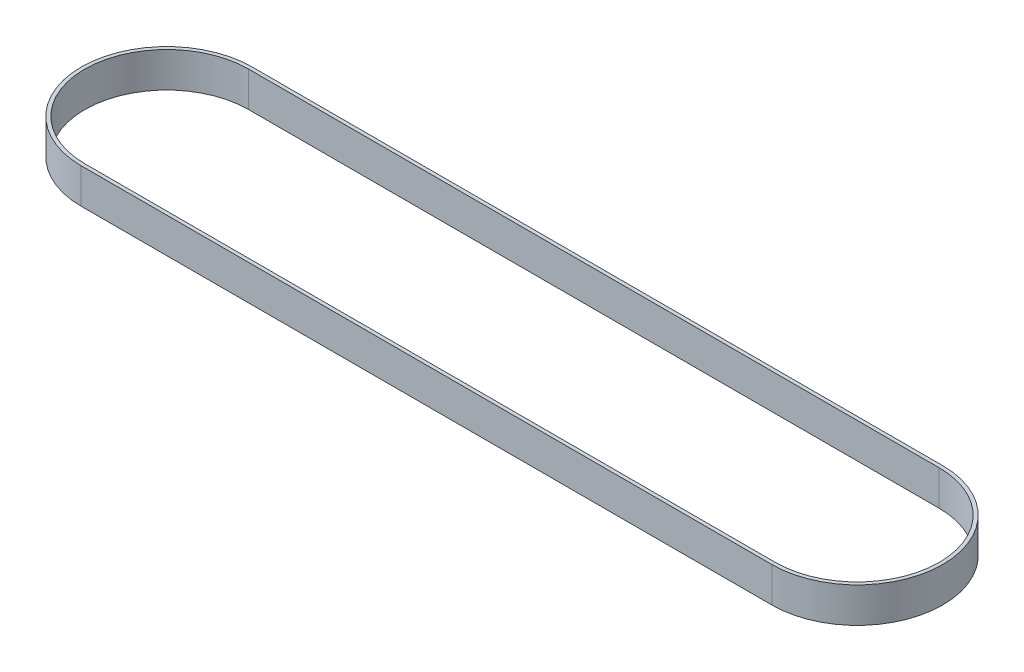
ISO-10303-21;
HEADER;
FILE_DESCRIPTION(('STEP AP214'),'2;1');
FILE_NAME('part.step','',(''),(''),'','','');
FILE_SCHEMA(('AUTOMOTIVE_DESIGN { 1 0 10303 214 1 1 1 1 }'));
ENDSEC;
DATA;
#1=APPLICATION_CONTEXT('core data for automotive mechanical design processes');
#2=APPLICATION_PROTOCOL_DEFINITION('international standard','automotive_design',2000,#1);
#3=PRODUCT_CONTEXT('',#1,'mechanical');
#4=PRODUCT('Part','Part','',(#3));
#5=PRODUCT_RELATED_PRODUCT_CATEGORY('part','',(#4));
#6=PRODUCT_DEFINITION_FORMATION('','',#4);
#7=PRODUCT_DEFINITION_CONTEXT('part definition',#1,'design');
#8=PRODUCT_DEFINITION('design','',#6,#7);
#9=PRODUCT_DEFINITION_SHAPE('','',#8);
#10=(LENGTH_UNIT() NAMED_UNIT(*) SI_UNIT(.MILLI.,.METRE.));
#11=(NAMED_UNIT(*) PLANE_ANGLE_UNIT() SI_UNIT($,.RADIAN.));
#12=(NAMED_UNIT(*) SI_UNIT($,.STERADIAN.) SOLID_ANGLE_UNIT());
#13=UNCERTAINTY_MEASURE_WITH_UNIT(LENGTH_MEASURE(1.E-05),#10,'distance_accuracy_value','');
#14=(GEOMETRIC_REPRESENTATION_CONTEXT(3) GLOBAL_UNCERTAINTY_ASSIGNED_CONTEXT((#13)) GLOBAL_UNIT_ASSIGNED_CONTEXT((#10,
#11,#12)) REPRESENTATION_CONTEXT('',''));
#15=CARTESIAN_POINT('',(0.,0.,0.));
#16=DIRECTION('',(0.,0.,1.));
#17=DIRECTION('',(1.,0.,0.));
#18=AXIS2_PLACEMENT_3D('',#15,#16,#17);
#19=CARTESIAN_POINT('',(0.,15.,-35.0139));
#20=DIRECTION('',(0.,0.,1.));
#21=DIRECTION('',(1.,0.,0.));
#22=AXIS2_PLACEMENT_3D('',#19,#20,#21);
#23=PLANE('',#22);
#24=DIRECTION('',(-1.,0.,0.));
#25=VECTOR('',#24,1.);
#26=CARTESIAN_POINT('',(0.,0.,-35.0139));
#27=LINE('',#26,#25);
#28=CARTESIAN_POINT('',(295.0718,0.,-35.0139));
#29=VERTEX_POINT('',#28);
#30=CARTESIAN_POINT('',(0.,0.,-35.0139));
#31=VERTEX_POINT('',#30);
#32=EDGE_CURVE('E158',#29,#31,#27,.T.);
#33=ORIENTED_EDGE('',*,*,#32,.F.);
#34=DIRECTION('',(0.,-1.,0.));
#35=VECTOR('',#34,1.);
#36=CARTESIAN_POINT('',(295.0718,15.,-35.0139));
#37=LINE('',#36,#35);
#38=CARTESIAN_POINT('',(295.0718,15.,-35.0139));
#39=VERTEX_POINT('',#38);
#40=EDGE_CURVE('E10',#39,#29,#37,.T.);
#41=ORIENTED_EDGE('',*,*,#40,.F.);
#42=DIRECTION('',(-1.,0.,0.));
#43=VECTOR('',#42,1.);
#44=CARTESIAN_POINT('',(0.,15.,-35.0139));
#45=LINE('',#44,#43);
#46=CARTESIAN_POINT('',(0.,15.,-35.0139));
#47=VERTEX_POINT('',#46);
#48=EDGE_CURVE('E123',#39,#47,#45,.T.);
#49=ORIENTED_EDGE('',*,*,#48,.T.);
#50=DIRECTION('',(0.,-1.,0.));
#51=VECTOR('',#50,1.);
#52=CARTESIAN_POINT('',(0.,15.,-35.0139));
#53=LINE('',#52,#51);
#54=EDGE_CURVE('E166',#47,#31,#53,.T.);
#55=ORIENTED_EDGE('',*,*,#54,.T.);
#56=EDGE_LOOP('',(#33,#41,#49,#55));
#57=FACE_BOUND('',#56,.T.);
#58=ADVANCED_FACE('F15',(#57),#23,.T.);
#59=CARTESIAN_POINT('',(295.0718,15.,0.));
#60=DIRECTION('',(0.,-1.,0.));
#61=DIRECTION('',(0.,0.,-1.));
#62=AXIS2_PLACEMENT_3D('',#59,#60,#61);
#63=CYLINDRICAL_SURFACE('',#62,35.0139);
#64=CARTESIAN_POINT('',(295.0718,0.,0.));
#65=DIRECTION('',(0.,1.,0.));
#66=DIRECTION('',(0.,0.,1.));
#67=AXIS2_PLACEMENT_3D('',#64,#65,#66);
#68=CIRCLE('',#67,35.0139);
#69=CARTESIAN_POINT('',(295.0718,0.,35.0139));
#70=VERTEX_POINT('',#69);
#71=EDGE_CURVE('E110',#70,#29,#68,.T.);
#72=ORIENTED_EDGE('',*,*,#71,.F.);
#73=DIRECTION('',(0.,-1.,0.));
#74=VECTOR('',#73,1.);
#75=CARTESIAN_POINT('',(295.0718,15.,35.0139));
#76=LINE('',#75,#74);
#77=CARTESIAN_POINT('',(295.0718,15.,35.0139));
#78=VERTEX_POINT('',#77);
#79=EDGE_CURVE('E26',#78,#70,#76,.T.);
#80=ORIENTED_EDGE('',*,*,#79,.F.);
#81=CARTESIAN_POINT('',(295.0718,15.,0.));
#82=DIRECTION('',(0.,1.,0.));
#83=DIRECTION('',(0.,0.,1.));
#84=AXIS2_PLACEMENT_3D('',#81,#82,#83);
#85=CIRCLE('',#84,35.0139);
#86=EDGE_CURVE('E107',#78,#39,#85,.T.);
#87=ORIENTED_EDGE('',*,*,#86,.T.);
#88=ORIENTED_EDGE('',*,*,#40,.T.);
#89=EDGE_LOOP('',(#72,#80,#87,#88));
#90=FACE_BOUND('',#89,.T.);
#91=ADVANCED_FACE('F106',(#90),#63,.F.);
#92=CARTESIAN_POINT('',(0.,15.,35.0139));
#93=DIRECTION('',(0.,0.,-1.));
#94=DIRECTION('',(-1.,0.,0.));
#95=AXIS2_PLACEMENT_3D('',#92,#93,#94);
#96=PLANE('',#95);
#97=DIRECTION('',(1.,0.,0.));
#98=VECTOR('',#97,1.);
#99=CARTESIAN_POINT('',(0.,0.,35.0139));
#100=LINE('',#99,#98);
#101=CARTESIAN_POINT('',(0.,0.,35.0139));
#102=VERTEX_POINT('',#101);
#103=EDGE_CURVE('E159',#102,#70,#100,.T.);
#104=ORIENTED_EDGE('',*,*,#103,.F.);
#105=DIRECTION('',(0.,-1.,0.));
#106=VECTOR('',#105,1.);
#107=CARTESIAN_POINT('',(0.,15.,35.0139));
#108=LINE('',#107,#106);
#109=CARTESIAN_POINT('',(0.,15.,35.0139));
#110=VERTEX_POINT('',#109);
#111=EDGE_CURVE('E116',#110,#102,#108,.T.);
#112=ORIENTED_EDGE('',*,*,#111,.F.);
#113=DIRECTION('',(1.,0.,0.));
#114=VECTOR('',#113,1.);
#115=CARTESIAN_POINT('',(0.,15.,35.0139));
#116=LINE('',#115,#114);
#117=EDGE_CURVE('E122',#110,#78,#116,.T.);
#118=ORIENTED_EDGE('',*,*,#117,.T.);
#119=ORIENTED_EDGE('',*,*,#79,.T.);
#120=EDGE_LOOP('',(#104,#112,#118,#119));
#121=FACE_BOUND('',#120,.T.);
#122=ADVANCED_FACE('F127',(#121),#96,.T.);
#123=CARTESIAN_POINT('',(0.,15.,0.));
#124=DIRECTION('',(0.,-1.,0.));
#125=DIRECTION('',(0.,0.,-1.));
#126=AXIS2_PLACEMENT_3D('',#123,#124,#125);
#127=CYLINDRICAL_SURFACE('',#126,35.0139);
#128=CARTESIAN_POINT('',(0.,0.,0.));
#129=DIRECTION('',(0.,1.,0.));
#130=DIRECTION('',(0.,0.,1.));
#131=AXIS2_PLACEMENT_3D('',#128,#129,#130);
#132=CIRCLE('',#131,35.0139);
#133=EDGE_CURVE('E199',#31,#102,#132,.T.);
#134=ORIENTED_EDGE('',*,*,#133,.F.);
#135=ORIENTED_EDGE('',*,*,#54,.F.);
#136=CARTESIAN_POINT('',(0.,15.,0.));
#137=DIRECTION('',(0.,1.,0.));
#138=DIRECTION('',(0.,0.,1.));
#139=AXIS2_PLACEMENT_3D('',#136,#137,#138);
#140=CIRCLE('',#139,35.0139);
#141=EDGE_CURVE('E130',#47,#110,#140,.T.);
#142=ORIENTED_EDGE('',*,*,#141,.T.);
#143=ORIENTED_EDGE('',*,*,#111,.T.);
#144=EDGE_LOOP('',(#134,#135,#142,#143));
#145=FACE_BOUND('',#144,.T.);
#146=ADVANCED_FACE('F271',(#145),#127,.F.);
#147=CARTESIAN_POINT('',(0.,15.,-36.5379));
#148=DIRECTION('',(0.,0.,1.));
#149=DIRECTION('',(1.,0.,0.));
#150=AXIS2_PLACEMENT_3D('',#147,#148,#149);
#151=PLANE('',#150);
#152=DIRECTION('',(-1.,0.,0.));
#153=VECTOR('',#152,1.);
#154=CARTESIAN_POINT('',(0.,0.,-36.5379));
#155=LINE('',#154,#153);
#156=CARTESIAN_POINT('',(295.0718,0.,-36.5379));
#157=VERTEX_POINT('',#156);
#158=CARTESIAN_POINT('',(0.,0.,-36.5379));
#159=VERTEX_POINT('',#158);
#160=EDGE_CURVE('E146',#157,#159,#155,.T.);
#161=ORIENTED_EDGE('',*,*,#160,.T.);
#162=DIRECTION('',(0.,-1.,0.));
#163=VECTOR('',#162,1.);
#164=CARTESIAN_POINT('',(0.,15.,-36.5379));
#165=LINE('',#164,#163);
#166=CARTESIAN_POINT('',(0.,15.,-36.5379));
#167=VERTEX_POINT('',#166);
#168=EDGE_CURVE('E88',#167,#159,#165,.T.);
#169=ORIENTED_EDGE('',*,*,#168,.F.);
#170=DIRECTION('',(-1.,0.,0.));
#171=VECTOR('',#170,1.);
#172=CARTESIAN_POINT('',(0.,15.,-36.5379));
#173=LINE('',#172,#171);
#174=CARTESIAN_POINT('',(295.0718,15.,-36.5379));
#175=VERTEX_POINT('',#174);
#176=EDGE_CURVE('E131',#175,#167,#173,.T.);
#177=ORIENTED_EDGE('',*,*,#176,.F.);
#178=DIRECTION('',(0.,-1.,0.));
#179=VECTOR('',#178,1.);
#180=CARTESIAN_POINT('',(295.0718,15.,-36.5379));
#181=LINE('',#180,#179);
#182=EDGE_CURVE('E150',#175,#157,#181,.T.);
#183=ORIENTED_EDGE('',*,*,#182,.T.);
#184=EDGE_LOOP('',(#161,#169,#177,#183));
#185=FACE_BOUND('',#184,.T.);
#186=ADVANCED_FACE('F17',(#185),#151,.F.);
#187=CARTESIAN_POINT('',(295.0718,15.,0.));
#188=DIRECTION('',(0.,-1.,0.));
#189=DIRECTION('',(0.,0.,-1.));
#190=AXIS2_PLACEMENT_3D('',#187,#188,#189);
#191=CYLINDRICAL_SURFACE('',#190,36.5379);
#192=CARTESIAN_POINT('',(295.0718,0.,0.));
#193=DIRECTION('',(0.,1.,0.));
#194=DIRECTION('',(0.,0.,1.));
#195=AXIS2_PLACEMENT_3D('',#192,#193,#194);
#196=CIRCLE('',#195,36.5379);
#197=CARTESIAN_POINT('',(295.0718,0.,36.5379));
#198=VERTEX_POINT('',#197);
#199=EDGE_CURVE('E151',#198,#157,#196,.T.);
#200=ORIENTED_EDGE('',*,*,#199,.T.);
#201=ORIENTED_EDGE('',*,*,#182,.F.);
#202=CARTESIAN_POINT('',(295.0718,15.,0.));
#203=DIRECTION('',(0.,1.,0.));
#204=DIRECTION('',(0.,0.,1.));
#205=AXIS2_PLACEMENT_3D('',#202,#203,#204);
#206=CIRCLE('',#205,36.5379);
#207=CARTESIAN_POINT('',(295.0718,15.,36.5379));
#208=VERTEX_POINT('',#207);
#209=EDGE_CURVE('E140',#208,#175,#206,.T.);
#210=ORIENTED_EDGE('',*,*,#209,.F.);
#211=DIRECTION('',(0.,-1.,0.));
#212=VECTOR('',#211,1.);
#213=CARTESIAN_POINT('',(295.0718,15.,36.5379));
#214=LINE('',#213,#212);
#215=EDGE_CURVE('E147',#208,#198,#214,.T.);
#216=ORIENTED_EDGE('',*,*,#215,.T.);
#217=EDGE_LOOP('',(#200,#201,#210,#216));
#218=FACE_BOUND('',#217,.T.);
#219=ADVANCED_FACE('F306',(#218),#191,.T.);
#220=CARTESIAN_POINT('',(0.,15.,36.5379));
#221=DIRECTION('',(0.,0.,-1.));
#222=DIRECTION('',(0.,-1.,0.));
#223=AXIS2_PLACEMENT_3D('',#220,#221,#222);
#224=PLANE('',#223);
#225=DIRECTION('',(1.,0.,0.));
#226=VECTOR('',#225,1.);
#227=CARTESIAN_POINT('',(0.,0.,36.5379));
#228=LINE('',#227,#226);
#229=CARTESIAN_POINT('',(0.,0.,36.5379));
#230=VERTEX_POINT('',#229);
#231=EDGE_CURVE('E155',#230,#198,#228,.T.);
#232=ORIENTED_EDGE('',*,*,#231,.T.);
#233=ORIENTED_EDGE('',*,*,#215,.F.);
#234=DIRECTION('',(1.,0.,0.));
#235=VECTOR('',#234,1.);
#236=CARTESIAN_POINT('',(0.,15.,36.5379));
#237=LINE('',#236,#235);
#238=CARTESIAN_POINT('',(0.,15.,36.5379));
#239=VERTEX_POINT('',#238);
#240=EDGE_CURVE('E251',#239,#208,#237,.T.);
#241=ORIENTED_EDGE('',*,*,#240,.F.);
#242=DIRECTION('',(0.,-1.,0.));
#243=VECTOR('',#242,1.);
#244=CARTESIAN_POINT('',(0.,15.,36.5379));
#245=LINE('',#244,#243);
#246=EDGE_CURVE('E160',#239,#230,#245,.T.);
#247=ORIENTED_EDGE('',*,*,#246,.T.);
#248=EDGE_LOOP('',(#232,#233,#241,#247));
#249=FACE_BOUND('',#248,.T.);
#250=ADVANCED_FACE('F311',(#249),#224,.F.);
#251=CARTESIAN_POINT('',(0.,15.,0.));
#252=DIRECTION('',(0.,-1.,0.));
#253=DIRECTION('',(0.,0.,-1.));
#254=AXIS2_PLACEMENT_3D('',#251,#252,#253);
#255=CYLINDRICAL_SURFACE('',#254,36.5379);
#256=CARTESIAN_POINT('',(0.,0.,0.));
#257=DIRECTION('',(0.,1.,0.));
#258=DIRECTION('',(0.,0.,1.));
#259=AXIS2_PLACEMENT_3D('',#256,#257,#258);
#260=CIRCLE('',#259,36.5379);
#261=EDGE_CURVE('E125',#159,#230,#260,.T.);
#262=ORIENTED_EDGE('',*,*,#261,.T.);
#263=ORIENTED_EDGE('',*,*,#246,.F.);
#264=CARTESIAN_POINT('',(0.,15.,0.));
#265=DIRECTION('',(0.,1.,0.));
#266=DIRECTION('',(0.,0.,1.));
#267=AXIS2_PLACEMENT_3D('',#264,#265,#266);
#268=CIRCLE('',#267,36.5379);
#269=EDGE_CURVE('E19',#167,#239,#268,.T.);
#270=ORIENTED_EDGE('',*,*,#269,.F.);
#271=ORIENTED_EDGE('',*,*,#168,.T.);
#272=EDGE_LOOP('',(#262,#263,#270,#271));
#273=FACE_BOUND('',#272,.T.);
#274=ADVANCED_FACE('F289',(#273),#255,.T.);
#275=CARTESIAN_POINT('',(0.,0.,0.));
#276=DIRECTION('',(0.,1.,0.));
#277=DIRECTION('',(1.,0.,0.));
#278=AXIS2_PLACEMENT_3D('',#275,#276,#277);
#279=PLANE('',#278);
#280=ORIENTED_EDGE('',*,*,#133,.T.);
#281=ORIENTED_EDGE('',*,*,#103,.T.);
#282=ORIENTED_EDGE('',*,*,#71,.T.);
#283=ORIENTED_EDGE('',*,*,#32,.T.);
#284=EDGE_LOOP('',(#280,#281,#282,#283));
#285=FACE_BOUND('',#284,.T.);
#286=ORIENTED_EDGE('',*,*,#261,.F.);
#287=ORIENTED_EDGE('',*,*,#160,.F.);
#288=ORIENTED_EDGE('',*,*,#199,.F.);
#289=ORIENTED_EDGE('',*,*,#231,.F.);
#290=EDGE_LOOP('',(#286,#287,#288,#289));
#291=FACE_BOUND('',#290,.T.);
#292=ADVANCED_FACE('F284',(#285,#291),#279,.F.);
#293=CARTESIAN_POINT('',(0.,15.,0.));
#294=DIRECTION('',(0.,1.,0.));
#295=DIRECTION('',(1.,0.,0.));
#296=AXIS2_PLACEMENT_3D('',#293,#294,#295);
#297=PLANE('',#296);
#298=ORIENTED_EDGE('',*,*,#117,.F.);
#299=ORIENTED_EDGE('',*,*,#141,.F.);
#300=ORIENTED_EDGE('',*,*,#48,.F.);
#301=ORIENTED_EDGE('',*,*,#86,.F.);
#302=EDGE_LOOP('',(#298,#299,#300,#301));
#303=FACE_BOUND('',#302,.T.);
#304=ORIENTED_EDGE('',*,*,#269,.T.);
#305=ORIENTED_EDGE('',*,*,#240,.T.);
#306=ORIENTED_EDGE('',*,*,#209,.T.);
#307=ORIENTED_EDGE('',*,*,#176,.T.);
#308=EDGE_LOOP('',(#304,#305,#306,#307));
#309=FACE_BOUND('',#308,.T.);
#310=ADVANCED_FACE('F119',(#303,#309),#297,.T.);
#311=CLOSED_SHELL('',(#58,#91,#122,#146,#186,#219,#250,#274,#292,#310));
#312=MANIFOLD_SOLID_BREP('B1',#311);
#313=ADVANCED_BREP_SHAPE_REPRESENTATION('',(#18,#312),#14);
#314=SHAPE_DEFINITION_REPRESENTATION(#9,#313);
ENDSEC;
END-ISO-10303-21;
